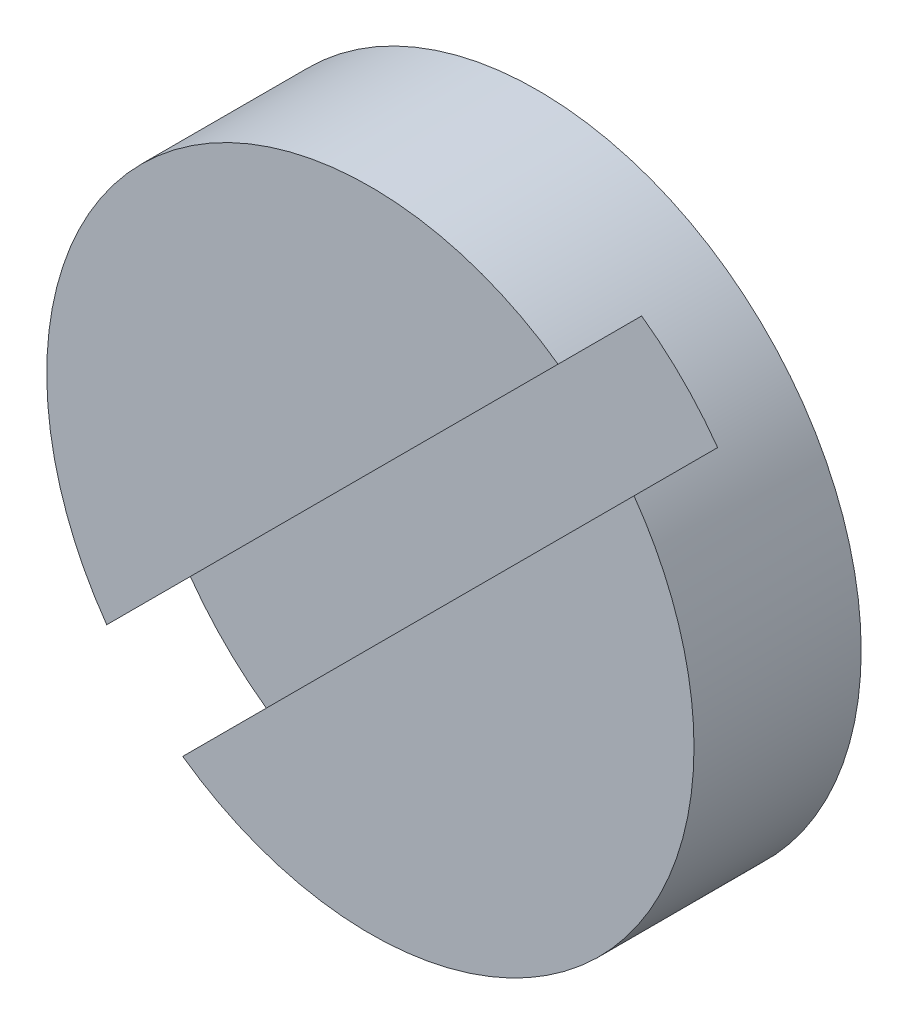
ISO-10303-21;
HEADER;
FILE_DESCRIPTION(('STEP AP214'),'2;1');
FILE_NAME('part.step','',(''),(''),'','','');
FILE_SCHEMA(('AUTOMOTIVE_DESIGN { 1 0 10303 214 1 1 1 1 }'));
ENDSEC;
DATA;
#1=APPLICATION_CONTEXT('core data for automotive mechanical design processes');
#2=APPLICATION_PROTOCOL_DEFINITION('international standard','automotive_design',2000,#1);
#3=PRODUCT_CONTEXT('',#1,'mechanical');
#4=PRODUCT('Part','Part','',(#3));
#5=PRODUCT_RELATED_PRODUCT_CATEGORY('part','',(#4));
#6=PRODUCT_DEFINITION_FORMATION('','',#4);
#7=PRODUCT_DEFINITION_CONTEXT('part definition',#1,'design');
#8=PRODUCT_DEFINITION('design','',#6,#7);
#9=PRODUCT_DEFINITION_SHAPE('','',#8);
#10=(LENGTH_UNIT() NAMED_UNIT(*) SI_UNIT(.MILLI.,.METRE.));
#11=(NAMED_UNIT(*) PLANE_ANGLE_UNIT() SI_UNIT($,.RADIAN.));
#12=(NAMED_UNIT(*) SI_UNIT($,.STERADIAN.) SOLID_ANGLE_UNIT());
#13=UNCERTAINTY_MEASURE_WITH_UNIT(LENGTH_MEASURE(1.E-05),#10,'distance_accuracy_value','');
#14=(GEOMETRIC_REPRESENTATION_CONTEXT(3) GLOBAL_UNCERTAINTY_ASSIGNED_CONTEXT((#13)) GLOBAL_UNIT_ASSIGNED_CONTEXT((#10,
#11,#12)) REPRESENTATION_CONTEXT('',''));
#15=CARTESIAN_POINT('',(0.,0.,0.));
#16=DIRECTION('',(0.,0.,1.));
#17=DIRECTION('',(1.,0.,0.));
#18=AXIS2_PLACEMENT_3D('',#15,#16,#17);
#19=CARTESIAN_POINT('',(54.5331207427251,28.8635307843678,15.6083));
#20=DIRECTION('',(0.707106781186549,-0.707106781186546,0.));
#21=DIRECTION('',(0.,0.,-1.));
#22=AXIS2_PLACEMENT_3D('',#19,#20,#21);
#23=PLANE('',#22);
#24=DIRECTION('',(0.,0.,1.));
#25=VECTOR('',#24,1.);
#26=CARTESIAN_POINT('',(59.8128197558129,34.1432297974556,15.0749));
#27=LINE('',#26,#25);
#28=CARTESIAN_POINT('',(59.8128197558127,34.1432297974555,14.6304));
#29=VERTEX_POINT('',#28);
#30=CARTESIAN_POINT('',(59.8128197558127,34.1432297974555,15.5194));
#31=VERTEX_POINT('',#30);
#32=EDGE_CURVE('E79',#29,#31,#27,.T.);
#33=ORIENTED_EDGE('',*,*,#32,.T.);
#34=DIRECTION('',(0.707106781186548,0.707106781186548,0.));
#35=VECTOR('',#34,1.);
#36=CARTESIAN_POINT('',(57.4129565680457,31.7433666096885,15.5194));
#37=LINE('',#36,#35);
#38=CARTESIAN_POINT('',(55.0130933802785,29.3435034219213,15.5194));
#39=VERTEX_POINT('',#38);
#40=EDGE_CURVE('E81',#39,#31,#37,.T.);
#41=ORIENTED_EDGE('',*,*,#40,.F.);
#42=DIRECTION('',(0.,0.,-1.));
#43=VECTOR('',#42,1.);
#44=CARTESIAN_POINT('',(55.0130933802785,29.3435034219212,15.0749));
#45=LINE('',#44,#43);
#46=CARTESIAN_POINT('',(55.0130933802785,29.3435034219213,14.6304));
#47=VERTEX_POINT('',#46);
#48=EDGE_CURVE('E82',#39,#47,#45,.T.);
#49=ORIENTED_EDGE('',*,*,#48,.T.);
#50=DIRECTION('',(-0.707106781186549,-0.707106781186546,0.));
#51=VECTOR('',#50,1.);
#52=CARTESIAN_POINT('',(57.4129565680455,31.7433666096883,14.6304));
#53=LINE('',#52,#51);
#54=EDGE_CURVE('E66',#29,#47,#53,.T.);
#55=ORIENTED_EDGE('',*,*,#54,.F.);
#56=EDGE_LOOP('',(#33,#41,#49,#55));
#57=FACE_BOUND('',#56,.T.);
#58=ADVANCED_FACE('F17',(#57),#23,.T.);
#59=CARTESIAN_POINT('',(57.0943388372413,38.5863385450642,15.5194));
#60=DIRECTION('',(0.,0.,1.));
#61=DIRECTION('',(-0.707106781186547,-0.707106781186548,0.));
#62=AXIS2_PLACEMENT_3D('',#59,#60,#61);
#63=PLANE('',#62);
#64=ORIENTED_EDGE('',*,*,#40,.T.);
#65=CARTESIAN_POINT('',(57.8170680934936,31.3392550842403,15.5194));
#66=DIRECTION('',(0.,0.,1.));
#67=DIRECTION('',(1.,0.,0.));
#68=AXIS2_PLACEMENT_3D('',#65,#66,#67);
#69=CIRCLE('',#68,3.44169999999972);
#70=EDGE_CURVE('E67',#39,#31,#69,.F.);
#71=ORIENTED_EDGE('',*,*,#70,.F.);
#72=EDGE_LOOP('',(#64,#71));
#73=FACE_BOUND('',#72,.T.);
#74=ADVANCED_FACE('F91',(#73),#63,.T.);
#75=CARTESIAN_POINT('',(57.8170680934936,24.6097157725237,14.6304));
#76=DIRECTION('',(0.,0.,1.));
#77=DIRECTION('',(0.707106781186552,0.707106781186543,0.));
#78=AXIS2_PLACEMENT_3D('',#75,#76,#77);
#79=PLANE('',#78);
#80=ORIENTED_EDGE('',*,*,#54,.T.);
#81=CARTESIAN_POINT('',(57.8170680934936,31.3392550842403,14.6304));
#82=DIRECTION('',(0.,0.,1.));
#83=DIRECTION('',(1.,0.,0.));
#84=AXIS2_PLACEMENT_3D('',#81,#82,#83);
#85=CIRCLE('',#84,3.44169999999972);
#86=CARTESIAN_POINT('',(55.8213164311746,28.5352803710252,14.6304));
#87=VERTEX_POINT('',#86);
#88=EDGE_CURVE('E21',#87,#47,#85,.F.);
#89=ORIENTED_EDGE('',*,*,#88,.F.);
#90=DIRECTION('',(-0.707106781186563,-0.707106781186532,0.));
#91=VECTOR('',#90,1.);
#92=CARTESIAN_POINT('',(58.2211796189418,30.9351435587922,14.6304));
#93=LINE('',#92,#91);
#94=CARTESIAN_POINT('',(60.6210428067089,33.3350067465592,14.6304));
#95=VERTEX_POINT('',#94);
#96=EDGE_CURVE('E63',#95,#87,#93,.T.);
#97=ORIENTED_EDGE('',*,*,#96,.F.);
#98=CARTESIAN_POINT('',(57.8170680934936,31.3392550842403,14.6304));
#99=DIRECTION('',(0.,0.,1.));
#100=DIRECTION('',(1.,0.,0.));
#101=AXIS2_PLACEMENT_3D('',#98,#99,#100);
#102=CIRCLE('',#101,3.44169999999972);
#103=EDGE_CURVE('E56',#29,#95,#102,.F.);
#104=ORIENTED_EDGE('',*,*,#103,.F.);
#105=EDGE_LOOP('',(#80,#89,#97,#104));
#106=FACE_BOUND('',#105,.T.);
#107=ADVANCED_FACE('F62',(#106),#79,.T.);
#108=CARTESIAN_POINT('',(55.3413437936212,28.0553077334717,14.5415));
#109=DIRECTION('',(-0.707106781186533,0.707106781186562,0.));
#110=DIRECTION('',(0.,0.,1.));
#111=AXIS2_PLACEMENT_3D('',#108,#109,#110);
#112=PLANE('',#111);
#113=DIRECTION('',(0.,0.,-1.));
#114=VECTOR('',#113,1.);
#115=CARTESIAN_POINT('',(60.6210428067091,33.3350067465594,15.0749));
#116=LINE('',#115,#114);
#117=CARTESIAN_POINT('',(60.6210428067089,33.3350067465593,15.5194));
#118=VERTEX_POINT('',#117);
#119=EDGE_CURVE('E71',#118,#95,#116,.T.);
#120=ORIENTED_EDGE('',*,*,#119,.T.);
#121=ORIENTED_EDGE('',*,*,#96,.T.);
#122=DIRECTION('',(0.,0.,1.));
#123=VECTOR('',#122,1.);
#124=CARTESIAN_POINT('',(55.8213164311746,28.5352803710251,15.0749));
#125=LINE('',#124,#123);
#126=CARTESIAN_POINT('',(55.8213164311746,28.5352803710252,15.5194));
#127=VERTEX_POINT('',#126);
#128=EDGE_CURVE('E36',#87,#127,#125,.T.);
#129=ORIENTED_EDGE('',*,*,#128,.T.);
#130=DIRECTION('',(-0.707106781186545,-0.70710678118655,0.));
#131=VECTOR('',#130,1.);
#132=CARTESIAN_POINT('',(58.2211796189418,30.9351435587923,15.5194));
#133=LINE('',#132,#131);
#134=EDGE_CURVE('E74',#118,#127,#133,.T.);
#135=ORIENTED_EDGE('',*,*,#134,.F.);
#136=EDGE_LOOP('',(#120,#121,#129,#135));
#137=FACE_BOUND('',#136,.T.);
#138=ADVANCED_FACE('F73',(#137),#112,.T.);
#139=CARTESIAN_POINT('',(49.6089257427987,31.3392550842403,13.7414));
#140=DIRECTION('',(0.,0.,-1.));
#141=DIRECTION('',(0.707106781186535,0.707106781186559,0.));
#142=AXIS2_PLACEMENT_3D('',#139,#140,#141);
#143=PLANE('',#142);
#144=CARTESIAN_POINT('',(57.8170680934936,31.3392550842403,13.7414));
#145=DIRECTION('',(0.,0.,1.));
#146=DIRECTION('',(1.,0.,0.));
#147=AXIS2_PLACEMENT_3D('',#144,#145,#146);
#148=CIRCLE('',#147,3.44169999999972);
#149=CARTESIAN_POINT('',(61.2587680934933,31.3392550842403,13.7414));
#150=VERTEX_POINT('',#149);
#151=EDGE_CURVE('E27',#150,#150,#148,.T.);
#152=ORIENTED_EDGE('',*,*,#151,.F.);
#153=EDGE_LOOP('',(#152));
#154=FACE_BOUND('',#153,.T.);
#155=ADVANCED_FACE('F107',(#154),#143,.T.);
#156=CARTESIAN_POINT('',(58.5397973497462,37.1408800325595,15.5194));
#157=DIRECTION('',(0.,0.,1.));
#158=DIRECTION('',(-0.707106781186547,-0.707106781186547,0.));
#159=AXIS2_PLACEMENT_3D('',#156,#157,#158);
#160=PLANE('',#159);
#161=ORIENTED_EDGE('',*,*,#134,.T.);
#162=CARTESIAN_POINT('',(57.8170680934936,31.3392550842403,15.5194));
#163=DIRECTION('',(0.,0.,1.));
#164=DIRECTION('',(1.,0.,0.));
#165=AXIS2_PLACEMENT_3D('',#162,#163,#164);
#166=CIRCLE('',#165,3.44169999999972);
#167=EDGE_CURVE('E11',#118,#127,#166,.F.);
#168=ORIENTED_EDGE('',*,*,#167,.F.);
#169=EDGE_LOOP('',(#161,#168));
#170=FACE_BOUND('',#169,.T.);
#171=ADVANCED_FACE('F19',(#170),#160,.T.);
#172=CARTESIAN_POINT('',(57.8170680934936,31.3392550842403,15.5194));
#173=DIRECTION('',(0.,0.,1.));
#174=DIRECTION('',(1.,0.,0.));
#175=AXIS2_PLACEMENT_3D('',#172,#173,#174);
#176=CYLINDRICAL_SURFACE('',#175,3.44169999999972);
#177=ORIENTED_EDGE('',*,*,#128,.F.);
#178=ORIENTED_EDGE('',*,*,#88,.T.);
#179=ORIENTED_EDGE('',*,*,#48,.F.);
#180=ORIENTED_EDGE('',*,*,#70,.T.);
#181=ORIENTED_EDGE('',*,*,#32,.F.);
#182=ORIENTED_EDGE('',*,*,#103,.T.);
#183=ORIENTED_EDGE('',*,*,#119,.F.);
#184=ORIENTED_EDGE('',*,*,#167,.T.);
#185=EDGE_LOOP('',(#177,#178,#179,#180,#181,#182,#183,#184));
#186=FACE_BOUND('',#185,.T.);
#187=ORIENTED_EDGE('',*,*,#151,.T.);
#188=EDGE_LOOP('',(#187));
#189=FACE_BOUND('',#188,.T.);
#190=ADVANCED_FACE('F68',(#186,#189),#176,.T.);
#191=CLOSED_SHELL('',(#58,#74,#107,#138,#155,#171,#190));
#192=MANIFOLD_SOLID_BREP('B1',#191);
#193=ADVANCED_BREP_SHAPE_REPRESENTATION('',(#18,#192),#14);
#194=SHAPE_DEFINITION_REPRESENTATION(#9,#193);
ENDSEC;
END-ISO-10303-21;
